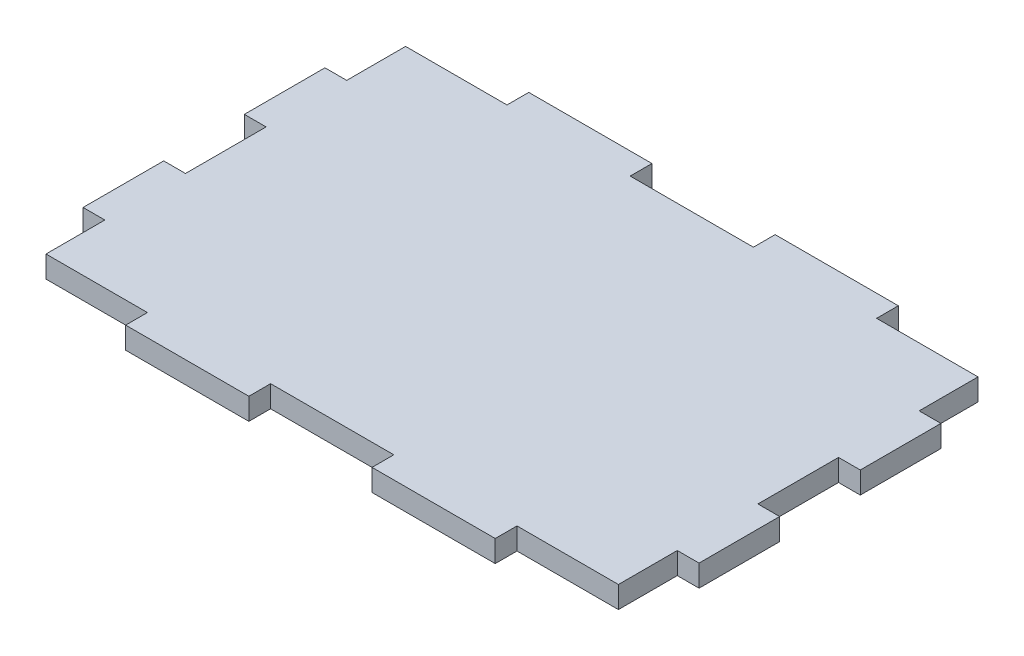
ISO-10303-21;
HEADER;
FILE_DESCRIPTION(('STEP AP214'),'2;1');
FILE_NAME('part.step','',(''),(''),'','','');
FILE_SCHEMA(('AUTOMOTIVE_DESIGN { 1 0 10303 214 1 1 1 1 }'));
ENDSEC;
DATA;
#1=APPLICATION_CONTEXT('core data for automotive mechanical design processes');
#2=APPLICATION_PROTOCOL_DEFINITION('international standard','automotive_design',2000,#1);
#3=PRODUCT_CONTEXT('',#1,'mechanical');
#4=PRODUCT('Part','Part','',(#3));
#5=PRODUCT_RELATED_PRODUCT_CATEGORY('part','',(#4));
#6=PRODUCT_DEFINITION_FORMATION('','',#4);
#7=PRODUCT_DEFINITION_CONTEXT('part definition',#1,'design');
#8=PRODUCT_DEFINITION('design','',#6,#7);
#9=PRODUCT_DEFINITION_SHAPE('','',#8);
#10=(LENGTH_UNIT() NAMED_UNIT(*) SI_UNIT(.MILLI.,.METRE.));
#11=(NAMED_UNIT(*) PLANE_ANGLE_UNIT() SI_UNIT($,.RADIAN.));
#12=(NAMED_UNIT(*) SI_UNIT($,.STERADIAN.) SOLID_ANGLE_UNIT());
#13=UNCERTAINTY_MEASURE_WITH_UNIT(LENGTH_MEASURE(1.E-05),#10,'distance_accuracy_value','');
#14=(GEOMETRIC_REPRESENTATION_CONTEXT(3) GLOBAL_UNCERTAINTY_ASSIGNED_CONTEXT((#13)) GLOBAL_UNIT_ASSIGNED_CONTEXT((#10,
#11,#12)) REPRESENTATION_CONTEXT('',''));
#15=CARTESIAN_POINT('',(0.,0.,0.));
#16=DIRECTION('',(0.,0.,1.));
#17=DIRECTION('',(1.,0.,0.));
#18=AXIS2_PLACEMENT_3D('',#15,#16,#17);
#19=CARTESIAN_POINT('',(-35.5,-2.7,15.));
#20=DIRECTION('',(-1.,0.,0.));
#21=DIRECTION('',(0.,0.,1.));
#22=AXIS2_PLACEMENT_3D('',#19,#20,#21);
#23=PLANE('',#22);
#24=DIRECTION('',(0.,0.,1.));
#25=VECTOR('',#24,1.);
#26=CARTESIAN_POINT('',(-35.5,0.,15.));
#27=LINE('',#26,#25);
#28=CARTESIAN_POINT('',(-35.5,0.,15.));
#29=VERTEX_POINT('',#28);
#30=CARTESIAN_POINT('',(-35.5,0.,22.3));
#31=VERTEX_POINT('',#30);
#32=EDGE_CURVE('E298',#29,#31,#27,.T.);
#33=ORIENTED_EDGE('',*,*,#32,.F.);
#34=DIRECTION('',(0.,1.,0.));
#35=VECTOR('',#34,1.);
#36=CARTESIAN_POINT('',(-35.5,-2.7,15.));
#37=LINE('',#36,#35);
#38=CARTESIAN_POINT('',(-35.5,-2.7,15.));
#39=VERTEX_POINT('',#38);
#40=EDGE_CURVE('E11',#39,#29,#37,.T.);
#41=ORIENTED_EDGE('',*,*,#40,.F.);
#42=DIRECTION('',(0.,0.,1.));
#43=VECTOR('',#42,1.);
#44=CARTESIAN_POINT('',(-35.5,-2.7,15.));
#45=LINE('',#44,#43);
#46=CARTESIAN_POINT('',(-35.5,-2.7,22.3));
#47=VERTEX_POINT('',#46);
#48=EDGE_CURVE('E402',#39,#47,#45,.T.);
#49=ORIENTED_EDGE('',*,*,#48,.T.);
#50=DIRECTION('',(0.,1.,0.));
#51=VECTOR('',#50,1.);
#52=CARTESIAN_POINT('',(-35.5,-2.7,22.3));
#53=LINE('',#52,#51);
#54=EDGE_CURVE('E36',#47,#31,#53,.T.);
#55=ORIENTED_EDGE('',*,*,#54,.T.);
#56=EDGE_LOOP('',(#33,#41,#49,#55));
#57=FACE_BOUND('',#56,.T.);
#58=ADVANCED_FACE('F33',(#57),#23,.T.);
#59=CARTESIAN_POINT('',(-38.2,-2.7,15.));
#60=DIRECTION('',(0.,0.,1.));
#61=DIRECTION('',(1.,0.,0.));
#62=AXIS2_PLACEMENT_3D('',#59,#60,#61);
#63=PLANE('',#62);
#64=DIRECTION('',(1.,0.,0.));
#65=VECTOR('',#64,1.);
#66=CARTESIAN_POINT('',(-38.2,0.,15.));
#67=LINE('',#66,#65);
#68=CARTESIAN_POINT('',(-38.2,0.,15.));
#69=VERTEX_POINT('',#68);
#70=EDGE_CURVE('E400',#69,#29,#67,.T.);
#71=ORIENTED_EDGE('',*,*,#70,.F.);
#72=DIRECTION('',(0.,1.,0.));
#73=VECTOR('',#72,1.);
#74=CARTESIAN_POINT('',(-38.2,-2.7,15.));
#75=LINE('',#74,#73);
#76=CARTESIAN_POINT('',(-38.2,-2.7,15.));
#77=VERTEX_POINT('',#76);
#78=EDGE_CURVE('E42',#77,#69,#75,.T.);
#79=ORIENTED_EDGE('',*,*,#78,.F.);
#80=DIRECTION('',(1.,0.,0.));
#81=VECTOR('',#80,1.);
#82=CARTESIAN_POINT('',(-38.2,-2.7,15.));
#83=LINE('',#82,#81);
#84=EDGE_CURVE('E288',#77,#39,#83,.T.);
#85=ORIENTED_EDGE('',*,*,#84,.T.);
#86=ORIENTED_EDGE('',*,*,#40,.T.);
#87=EDGE_LOOP('',(#71,#79,#85,#86));
#88=FACE_BOUND('',#87,.T.);
#89=ADVANCED_FACE('F470',(#88),#63,.T.);
#90=CARTESIAN_POINT('',(-38.2,-2.7,15.));
#91=DIRECTION('',(-1.,0.,0.));
#92=DIRECTION('',(0.,0.,1.));
#93=AXIS2_PLACEMENT_3D('',#90,#91,#92);
#94=PLANE('',#93);
#95=DIRECTION('',(0.,0.,1.));
#96=VECTOR('',#95,1.);
#97=CARTESIAN_POINT('',(-38.2,0.,15.));
#98=LINE('',#97,#96);
#99=CARTESIAN_POINT('',(-38.2,0.,5.));
#100=VERTEX_POINT('',#99);
#101=EDGE_CURVE('E275',#100,#69,#98,.T.);
#102=ORIENTED_EDGE('',*,*,#101,.F.);
#103=DIRECTION('',(0.,1.,0.));
#104=VECTOR('',#103,1.);
#105=CARTESIAN_POINT('',(-38.2,-2.7,5.));
#106=LINE('',#105,#104);
#107=CARTESIAN_POINT('',(-38.2,-2.7,5.));
#108=VERTEX_POINT('',#107);
#109=EDGE_CURVE('E270',#108,#100,#106,.T.);
#110=ORIENTED_EDGE('',*,*,#109,.F.);
#111=DIRECTION('',(0.,0.,1.));
#112=VECTOR('',#111,1.);
#113=CARTESIAN_POINT('',(-38.2,-2.7,15.));
#114=LINE('',#113,#112);
#115=EDGE_CURVE('E273',#108,#77,#114,.T.);
#116=ORIENTED_EDGE('',*,*,#115,.T.);
#117=ORIENTED_EDGE('',*,*,#78,.T.);
#118=EDGE_LOOP('',(#102,#110,#116,#117));
#119=FACE_BOUND('',#118,.T.);
#120=ADVANCED_FACE('F272',(#119),#94,.T.);
#121=CARTESIAN_POINT('',(-38.2,-2.7,5.));
#122=DIRECTION('',(0.,0.,-1.));
#123=DIRECTION('',(-1.,0.,0.));
#124=AXIS2_PLACEMENT_3D('',#121,#122,#123);
#125=PLANE('',#124);
#126=DIRECTION('',(-1.,0.,0.));
#127=VECTOR('',#126,1.);
#128=CARTESIAN_POINT('',(-38.2,0.,5.));
#129=LINE('',#128,#127);
#130=CARTESIAN_POINT('',(-35.5,0.,5.));
#131=VERTEX_POINT('',#130);
#132=EDGE_CURVE('E397',#131,#100,#129,.T.);
#133=ORIENTED_EDGE('',*,*,#132,.F.);
#134=DIRECTION('',(0.,1.,0.));
#135=VECTOR('',#134,1.);
#136=CARTESIAN_POINT('',(-35.5,-2.7,5.));
#137=LINE('',#136,#135);
#138=CARTESIAN_POINT('',(-35.5,-2.7,5.));
#139=VERTEX_POINT('',#138);
#140=EDGE_CURVE('E280',#139,#131,#137,.T.);
#141=ORIENTED_EDGE('',*,*,#140,.F.);
#142=DIRECTION('',(-1.,0.,0.));
#143=VECTOR('',#142,1.);
#144=CARTESIAN_POINT('',(-38.2,-2.7,5.));
#145=LINE('',#144,#143);
#146=EDGE_CURVE('E286',#139,#108,#145,.T.);
#147=ORIENTED_EDGE('',*,*,#146,.T.);
#148=ORIENTED_EDGE('',*,*,#109,.T.);
#149=EDGE_LOOP('',(#133,#141,#147,#148));
#150=FACE_BOUND('',#149,.T.);
#151=ADVANCED_FACE('F290',(#150),#125,.T.);
#152=CARTESIAN_POINT('',(-35.5,-2.7,-5.));
#153=DIRECTION('',(-1.,0.,0.));
#154=DIRECTION('',(0.,0.,1.));
#155=AXIS2_PLACEMENT_3D('',#152,#153,#154);
#156=PLANE('',#155);
#157=DIRECTION('',(0.,0.,1.));
#158=VECTOR('',#157,1.);
#159=CARTESIAN_POINT('',(-35.5,0.,-5.));
#160=LINE('',#159,#158);
#161=CARTESIAN_POINT('',(-35.5,0.,-5.));
#162=VERTEX_POINT('',#161);
#163=EDGE_CURVE('E394',#162,#131,#160,.T.);
#164=ORIENTED_EDGE('',*,*,#163,.F.);
#165=DIRECTION('',(0.,1.,0.));
#166=VECTOR('',#165,1.);
#167=CARTESIAN_POINT('',(-35.5,-2.7,-5.));
#168=LINE('',#167,#166);
#169=CARTESIAN_POINT('',(-35.5,-2.7,-5.));
#170=VERTEX_POINT('',#169);
#171=EDGE_CURVE('E406',#170,#162,#168,.T.);
#172=ORIENTED_EDGE('',*,*,#171,.F.);
#173=DIRECTION('',(0.,0.,1.));
#174=VECTOR('',#173,1.);
#175=CARTESIAN_POINT('',(-35.5,-2.7,-5.));
#176=LINE('',#175,#174);
#177=EDGE_CURVE('E291',#170,#139,#176,.T.);
#178=ORIENTED_EDGE('',*,*,#177,.T.);
#179=ORIENTED_EDGE('',*,*,#140,.T.);
#180=EDGE_LOOP('',(#164,#172,#178,#179));
#181=FACE_BOUND('',#180,.T.);
#182=ADVANCED_FACE('F483',(#181),#156,.T.);
#183=CARTESIAN_POINT('',(-38.2,-2.7,-5.));
#184=DIRECTION('',(0.,0.,1.));
#185=DIRECTION('',(1.,0.,0.));
#186=AXIS2_PLACEMENT_3D('',#183,#184,#185);
#187=PLANE('',#186);
#188=DIRECTION('',(1.,0.,0.));
#189=VECTOR('',#188,1.);
#190=CARTESIAN_POINT('',(-38.2,0.,-5.));
#191=LINE('',#190,#189);
#192=CARTESIAN_POINT('',(-38.2,0.,-5.));
#193=VERTEX_POINT('',#192);
#194=EDGE_CURVE('E391',#193,#162,#191,.T.);
#195=ORIENTED_EDGE('',*,*,#194,.F.);
#196=DIRECTION('',(0.,1.,0.));
#197=VECTOR('',#196,1.);
#198=CARTESIAN_POINT('',(-38.2,-2.7,-5.));
#199=LINE('',#198,#197);
#200=CARTESIAN_POINT('',(-38.2,-2.7,-5.));
#201=VERTEX_POINT('',#200);
#202=EDGE_CURVE('E408',#201,#193,#199,.T.);
#203=ORIENTED_EDGE('',*,*,#202,.F.);
#204=DIRECTION('',(1.,0.,0.));
#205=VECTOR('',#204,1.);
#206=CARTESIAN_POINT('',(-38.2,-2.7,-5.));
#207=LINE('',#206,#205);
#208=EDGE_CURVE('E293',#201,#170,#207,.T.);
#209=ORIENTED_EDGE('',*,*,#208,.T.);
#210=ORIENTED_EDGE('',*,*,#171,.T.);
#211=EDGE_LOOP('',(#195,#203,#209,#210));
#212=FACE_BOUND('',#211,.T.);
#213=ADVANCED_FACE('F486',(#212),#187,.T.);
#214=CARTESIAN_POINT('',(-38.2,-2.7,-5.));
#215=DIRECTION('',(-1.,0.,0.));
#216=DIRECTION('',(0.,0.,1.));
#217=AXIS2_PLACEMENT_3D('',#214,#215,#216);
#218=PLANE('',#217);
#219=DIRECTION('',(0.,0.,1.));
#220=VECTOR('',#219,1.);
#221=CARTESIAN_POINT('',(-38.2,0.,-5.));
#222=LINE('',#221,#220);
#223=CARTESIAN_POINT('',(-38.2,0.,-15.));
#224=VERTEX_POINT('',#223);
#225=EDGE_CURVE('E388',#224,#193,#222,.T.);
#226=ORIENTED_EDGE('',*,*,#225,.F.);
#227=DIRECTION('',(0.,1.,0.));
#228=VECTOR('',#227,1.);
#229=CARTESIAN_POINT('',(-38.2,-2.7,-15.));
#230=LINE('',#229,#228);
#231=CARTESIAN_POINT('',(-38.2,-2.7,-15.));
#232=VERTEX_POINT('',#231);
#233=EDGE_CURVE('E410',#232,#224,#230,.T.);
#234=ORIENTED_EDGE('',*,*,#233,.F.);
#235=DIRECTION('',(0.,0.,1.));
#236=VECTOR('',#235,1.);
#237=CARTESIAN_POINT('',(-38.2,-2.7,-5.));
#238=LINE('',#237,#236);
#239=EDGE_CURVE('E940',#232,#201,#238,.T.);
#240=ORIENTED_EDGE('',*,*,#239,.T.);
#241=ORIENTED_EDGE('',*,*,#202,.T.);
#242=EDGE_LOOP('',(#226,#234,#240,#241));
#243=FACE_BOUND('',#242,.T.);
#244=ADVANCED_FACE('F490',(#243),#218,.T.);
#245=CARTESIAN_POINT('',(-38.2,-2.7,-15.));
#246=DIRECTION('',(0.,0.,-1.));
#247=DIRECTION('',(-1.,0.,0.));
#248=AXIS2_PLACEMENT_3D('',#245,#246,#247);
#249=PLANE('',#248);
#250=DIRECTION('',(-1.,0.,0.));
#251=VECTOR('',#250,1.);
#252=CARTESIAN_POINT('',(-38.2,0.,-15.));
#253=LINE('',#252,#251);
#254=CARTESIAN_POINT('',(-35.5,0.,-15.));
#255=VERTEX_POINT('',#254);
#256=EDGE_CURVE('E385',#255,#224,#253,.T.);
#257=ORIENTED_EDGE('',*,*,#256,.F.);
#258=DIRECTION('',(0.,1.,0.));
#259=VECTOR('',#258,1.);
#260=CARTESIAN_POINT('',(-35.5,-2.7,-15.));
#261=LINE('',#260,#259);
#262=CARTESIAN_POINT('',(-35.5,-2.7,-15.));
#263=VERTEX_POINT('',#262);
#264=EDGE_CURVE('E412',#263,#255,#261,.T.);
#265=ORIENTED_EDGE('',*,*,#264,.F.);
#266=DIRECTION('',(-1.,0.,0.));
#267=VECTOR('',#266,1.);
#268=CARTESIAN_POINT('',(-38.2,-2.7,-15.));
#269=LINE('',#268,#267);
#270=EDGE_CURVE('E944',#263,#232,#269,.T.);
#271=ORIENTED_EDGE('',*,*,#270,.T.);
#272=ORIENTED_EDGE('',*,*,#233,.T.);
#273=EDGE_LOOP('',(#257,#265,#271,#272));
#274=FACE_BOUND('',#273,.T.);
#275=ADVANCED_FACE('F494',(#274),#249,.T.);
#276=CARTESIAN_POINT('',(-35.5,-2.7,-22.3));
#277=DIRECTION('',(-1.,0.,0.));
#278=DIRECTION('',(0.,0.,1.));
#279=AXIS2_PLACEMENT_3D('',#276,#277,#278);
#280=PLANE('',#279);
#281=DIRECTION('',(0.,0.,1.));
#282=VECTOR('',#281,1.);
#283=CARTESIAN_POINT('',(-35.5,0.,-22.3));
#284=LINE('',#283,#282);
#285=CARTESIAN_POINT('',(-35.5,0.,-22.3));
#286=VERTEX_POINT('',#285);
#287=EDGE_CURVE('E382',#286,#255,#284,.T.);
#288=ORIENTED_EDGE('',*,*,#287,.F.);
#289=DIRECTION('',(0.,1.,0.));
#290=VECTOR('',#289,1.);
#291=CARTESIAN_POINT('',(-35.5,-2.7,-22.3));
#292=LINE('',#291,#290);
#293=CARTESIAN_POINT('',(-35.5,-2.7,-22.3));
#294=VERTEX_POINT('',#293);
#295=EDGE_CURVE('E414',#294,#286,#292,.T.);
#296=ORIENTED_EDGE('',*,*,#295,.F.);
#297=DIRECTION('',(0.,0.,1.));
#298=VECTOR('',#297,1.);
#299=CARTESIAN_POINT('',(-35.5,-2.7,-22.3));
#300=LINE('',#299,#298);
#301=EDGE_CURVE('E933',#294,#263,#300,.T.);
#302=ORIENTED_EDGE('',*,*,#301,.T.);
#303=ORIENTED_EDGE('',*,*,#264,.T.);
#304=EDGE_LOOP('',(#288,#296,#302,#303));
#305=FACE_BOUND('',#304,.T.);
#306=ADVANCED_FACE('F498',(#305),#280,.T.);
#307=CARTESIAN_POINT('',(-22.92,-2.7,-22.3));
#308=DIRECTION('',(0.,0.,-1.));
#309=DIRECTION('',(-1.,0.,0.));
#310=AXIS2_PLACEMENT_3D('',#307,#308,#309);
#311=PLANE('',#310);
#312=DIRECTION('',(-1.,0.,0.));
#313=VECTOR('',#312,1.);
#314=CARTESIAN_POINT('',(-22.92,0.,-22.3));
#315=LINE('',#314,#313);
#316=CARTESIAN_POINT('',(-22.92,0.,-22.3));
#317=VERTEX_POINT('',#316);
#318=EDGE_CURVE('E379',#317,#286,#315,.T.);
#319=ORIENTED_EDGE('',*,*,#318,.F.);
#320=DIRECTION('',(0.,1.,0.));
#321=VECTOR('',#320,1.);
#322=CARTESIAN_POINT('',(-22.92,-2.7,-22.3));
#323=LINE('',#322,#321);
#324=CARTESIAN_POINT('',(-22.92,-2.7,-22.3));
#325=VERTEX_POINT('',#324);
#326=EDGE_CURVE('E416',#325,#317,#323,.T.);
#327=ORIENTED_EDGE('',*,*,#326,.F.);
#328=DIRECTION('',(-1.,0.,0.));
#329=VECTOR('',#328,1.);
#330=CARTESIAN_POINT('',(-22.92,-2.7,-22.3));
#331=LINE('',#330,#329);
#332=EDGE_CURVE('E929',#325,#294,#331,.T.);
#333=ORIENTED_EDGE('',*,*,#332,.T.);
#334=ORIENTED_EDGE('',*,*,#295,.T.);
#335=EDGE_LOOP('',(#319,#327,#333,#334));
#336=FACE_BOUND('',#335,.T.);
#337=ADVANCED_FACE('F502',(#336),#311,.T.);
#338=CARTESIAN_POINT('',(-22.92,-2.7,-22.3));
#339=DIRECTION('',(-1.,0.,0.));
#340=DIRECTION('',(0.,0.,1.));
#341=AXIS2_PLACEMENT_3D('',#338,#339,#340);
#342=PLANE('',#341);
#343=DIRECTION('',(0.,0.,1.));
#344=VECTOR('',#343,1.);
#345=CARTESIAN_POINT('',(-22.92,0.,-22.3));
#346=LINE('',#345,#344);
#347=CARTESIAN_POINT('',(-22.92,0.,-25.));
#348=VERTEX_POINT('',#347);
#349=EDGE_CURVE('E376',#348,#317,#346,.T.);
#350=ORIENTED_EDGE('',*,*,#349,.F.);
#351=DIRECTION('',(0.,1.,0.));
#352=VECTOR('',#351,1.);
#353=CARTESIAN_POINT('',(-22.92,-2.7,-25.));
#354=LINE('',#353,#352);
#355=CARTESIAN_POINT('',(-22.92,-2.7,-25.));
#356=VERTEX_POINT('',#355);
#357=EDGE_CURVE('E418',#356,#348,#354,.T.);
#358=ORIENTED_EDGE('',*,*,#357,.F.);
#359=DIRECTION('',(0.,0.,1.));
#360=VECTOR('',#359,1.);
#361=CARTESIAN_POINT('',(-22.92,-2.7,-22.3));
#362=LINE('',#361,#360);
#363=EDGE_CURVE('E950',#356,#325,#362,.T.);
#364=ORIENTED_EDGE('',*,*,#363,.T.);
#365=ORIENTED_EDGE('',*,*,#326,.T.);
#366=EDGE_LOOP('',(#350,#358,#364,#365));
#367=FACE_BOUND('',#366,.T.);
#368=ADVANCED_FACE('F506',(#367),#342,.T.);
#369=CARTESIAN_POINT('',(-7.64000000000001,-2.7,-25.));
#370=DIRECTION('',(0.,0.,-1.));
#371=DIRECTION('',(-1.,0.,0.));
#372=AXIS2_PLACEMENT_3D('',#369,#370,#371);
#373=PLANE('',#372);
#374=DIRECTION('',(-1.,0.,0.));
#375=VECTOR('',#374,1.);
#376=CARTESIAN_POINT('',(-7.64000000000001,0.,-25.));
#377=LINE('',#376,#375);
#378=CARTESIAN_POINT('',(-7.64000000000001,0.,-25.));
#379=VERTEX_POINT('',#378);
#380=EDGE_CURVE('E373',#379,#348,#377,.T.);
#381=ORIENTED_EDGE('',*,*,#380,.F.);
#382=DIRECTION('',(0.,1.,0.));
#383=VECTOR('',#382,1.);
#384=CARTESIAN_POINT('',(-7.64000000000001,-2.7,-25.));
#385=LINE('',#384,#383);
#386=CARTESIAN_POINT('',(-7.64000000000001,-2.7,-25.));
#387=VERTEX_POINT('',#386);
#388=EDGE_CURVE('E420',#387,#379,#385,.T.);
#389=ORIENTED_EDGE('',*,*,#388,.F.);
#390=DIRECTION('',(-1.,0.,0.));
#391=VECTOR('',#390,1.);
#392=CARTESIAN_POINT('',(-7.64000000000001,-2.7,-25.));
#393=LINE('',#392,#391);
#394=EDGE_CURVE('E922',#387,#356,#393,.T.);
#395=ORIENTED_EDGE('',*,*,#394,.T.);
#396=ORIENTED_EDGE('',*,*,#357,.T.);
#397=EDGE_LOOP('',(#381,#389,#395,#396));
#398=FACE_BOUND('',#397,.T.);
#399=ADVANCED_FACE('F510',(#398),#373,.T.);
#400=CARTESIAN_POINT('',(-7.64000000000001,-2.7,-22.3));
#401=DIRECTION('',(1.,0.,0.));
#402=DIRECTION('',(0.,0.,-1.));
#403=AXIS2_PLACEMENT_3D('',#400,#401,#402);
#404=PLANE('',#403);
#405=DIRECTION('',(0.,0.,-1.));
#406=VECTOR('',#405,1.);
#407=CARTESIAN_POINT('',(-7.64000000000001,0.,-22.3));
#408=LINE('',#407,#406);
#409=CARTESIAN_POINT('',(-7.64000000000001,0.,-22.3));
#410=VERTEX_POINT('',#409);
#411=EDGE_CURVE('E370',#410,#379,#408,.T.);
#412=ORIENTED_EDGE('',*,*,#411,.F.);
#413=DIRECTION('',(0.,1.,0.));
#414=VECTOR('',#413,1.);
#415=CARTESIAN_POINT('',(-7.64000000000001,-2.7,-22.3));
#416=LINE('',#415,#414);
#417=CARTESIAN_POINT('',(-7.64000000000001,-2.7,-22.3));
#418=VERTEX_POINT('',#417);
#419=EDGE_CURVE('E422',#418,#410,#416,.T.);
#420=ORIENTED_EDGE('',*,*,#419,.F.);
#421=DIRECTION('',(0.,0.,-1.));
#422=VECTOR('',#421,1.);
#423=CARTESIAN_POINT('',(-7.64000000000001,-2.7,-22.3));
#424=LINE('',#423,#422);
#425=EDGE_CURVE('E918',#418,#387,#424,.T.);
#426=ORIENTED_EDGE('',*,*,#425,.T.);
#427=ORIENTED_EDGE('',*,*,#388,.T.);
#428=EDGE_LOOP('',(#412,#420,#426,#427));
#429=FACE_BOUND('',#428,.T.);
#430=ADVANCED_FACE('F514',(#429),#404,.T.);
#431=CARTESIAN_POINT('',(7.63999999999999,-2.7,-22.3));
#432=DIRECTION('',(0.,0.,-1.));
#433=DIRECTION('',(-1.,0.,0.));
#434=AXIS2_PLACEMENT_3D('',#431,#432,#433);
#435=PLANE('',#434);
#436=DIRECTION('',(-1.,0.,0.));
#437=VECTOR('',#436,1.);
#438=CARTESIAN_POINT('',(7.63999999999999,0.,-22.3));
#439=LINE('',#438,#437);
#440=CARTESIAN_POINT('',(7.63999999999999,0.,-22.3));
#441=VERTEX_POINT('',#440);
#442=EDGE_CURVE('E367',#441,#410,#439,.T.);
#443=ORIENTED_EDGE('',*,*,#442,.F.);
#444=DIRECTION('',(0.,1.,0.));
#445=VECTOR('',#444,1.);
#446=CARTESIAN_POINT('',(7.63999999999999,-2.7,-22.3));
#447=LINE('',#446,#445);
#448=CARTESIAN_POINT('',(7.63999999999999,-2.7,-22.3));
#449=VERTEX_POINT('',#448);
#450=EDGE_CURVE('E424',#449,#441,#447,.T.);
#451=ORIENTED_EDGE('',*,*,#450,.F.);
#452=DIRECTION('',(-1.,0.,0.));
#453=VECTOR('',#452,1.);
#454=CARTESIAN_POINT('',(7.63999999999999,-2.7,-22.3));
#455=LINE('',#454,#453);
#456=EDGE_CURVE('E954',#449,#418,#455,.T.);
#457=ORIENTED_EDGE('',*,*,#456,.T.);
#458=ORIENTED_EDGE('',*,*,#419,.T.);
#459=EDGE_LOOP('',(#443,#451,#457,#458));
#460=FACE_BOUND('',#459,.T.);
#461=ADVANCED_FACE('F518',(#460),#435,.T.);
#462=CARTESIAN_POINT('',(7.63999999999999,-2.7,-22.3));
#463=DIRECTION('',(-1.,0.,0.));
#464=DIRECTION('',(0.,0.,1.));
#465=AXIS2_PLACEMENT_3D('',#462,#463,#464);
#466=PLANE('',#465);
#467=DIRECTION('',(0.,0.,1.));
#468=VECTOR('',#467,1.);
#469=CARTESIAN_POINT('',(7.63999999999999,0.,-22.3));
#470=LINE('',#469,#468);
#471=CARTESIAN_POINT('',(7.63999999999999,0.,-25.));
#472=VERTEX_POINT('',#471);
#473=EDGE_CURVE('E364',#472,#441,#470,.T.);
#474=ORIENTED_EDGE('',*,*,#473,.F.);
#475=DIRECTION('',(0.,1.,0.));
#476=VECTOR('',#475,1.);
#477=CARTESIAN_POINT('',(7.63999999999999,-2.7,-25.));
#478=LINE('',#477,#476);
#479=CARTESIAN_POINT('',(7.63999999999999,-2.7,-25.));
#480=VERTEX_POINT('',#479);
#481=EDGE_CURVE('E426',#480,#472,#478,.T.);
#482=ORIENTED_EDGE('',*,*,#481,.F.);
#483=DIRECTION('',(0.,0.,1.));
#484=VECTOR('',#483,1.);
#485=CARTESIAN_POINT('',(7.63999999999999,-2.7,-22.3));
#486=LINE('',#485,#484);
#487=EDGE_CURVE('E911',#480,#449,#486,.T.);
#488=ORIENTED_EDGE('',*,*,#487,.T.);
#489=ORIENTED_EDGE('',*,*,#450,.T.);
#490=EDGE_LOOP('',(#474,#482,#488,#489));
#491=FACE_BOUND('',#490,.T.);
#492=ADVANCED_FACE('F522',(#491),#466,.T.);
#493=CARTESIAN_POINT('',(22.92,-2.7,-25.));
#494=DIRECTION('',(0.,0.,-1.));
#495=DIRECTION('',(-1.,0.,0.));
#496=AXIS2_PLACEMENT_3D('',#493,#494,#495);
#497=PLANE('',#496);
#498=DIRECTION('',(-1.,0.,0.));
#499=VECTOR('',#498,1.);
#500=CARTESIAN_POINT('',(22.92,0.,-25.));
#501=LINE('',#500,#499);
#502=CARTESIAN_POINT('',(22.92,0.,-25.));
#503=VERTEX_POINT('',#502);
#504=EDGE_CURVE('E361',#503,#472,#501,.T.);
#505=ORIENTED_EDGE('',*,*,#504,.F.);
#506=DIRECTION('',(0.,1.,0.));
#507=VECTOR('',#506,1.);
#508=CARTESIAN_POINT('',(22.92,-2.7,-25.));
#509=LINE('',#508,#507);
#510=CARTESIAN_POINT('',(22.92,-2.7,-25.));
#511=VERTEX_POINT('',#510);
#512=EDGE_CURVE('E428',#511,#503,#509,.T.);
#513=ORIENTED_EDGE('',*,*,#512,.F.);
#514=DIRECTION('',(-1.,0.,0.));
#515=VECTOR('',#514,1.);
#516=CARTESIAN_POINT('',(22.92,-2.7,-25.));
#517=LINE('',#516,#515);
#518=EDGE_CURVE('E907',#511,#480,#517,.T.);
#519=ORIENTED_EDGE('',*,*,#518,.T.);
#520=ORIENTED_EDGE('',*,*,#481,.T.);
#521=EDGE_LOOP('',(#505,#513,#519,#520));
#522=FACE_BOUND('',#521,.T.);
#523=ADVANCED_FACE('F526',(#522),#497,.T.);
#524=CARTESIAN_POINT('',(22.92,-2.7,-22.3));
#525=DIRECTION('',(1.,0.,0.));
#526=DIRECTION('',(0.,0.,-1.));
#527=AXIS2_PLACEMENT_3D('',#524,#525,#526);
#528=PLANE('',#527);
#529=DIRECTION('',(0.,0.,-1.));
#530=VECTOR('',#529,1.);
#531=CARTESIAN_POINT('',(22.92,0.,-22.3));
#532=LINE('',#531,#530);
#533=CARTESIAN_POINT('',(22.92,0.,-22.3));
#534=VERTEX_POINT('',#533);
#535=EDGE_CURVE('E358',#534,#503,#532,.T.);
#536=ORIENTED_EDGE('',*,*,#535,.F.);
#537=DIRECTION('',(0.,1.,0.));
#538=VECTOR('',#537,1.);
#539=CARTESIAN_POINT('',(22.92,-2.7,-22.3));
#540=LINE('',#539,#538);
#541=CARTESIAN_POINT('',(22.92,-2.7,-22.3));
#542=VERTEX_POINT('',#541);
#543=EDGE_CURVE('E430',#542,#534,#540,.T.);
#544=ORIENTED_EDGE('',*,*,#543,.F.);
#545=DIRECTION('',(0.,0.,-1.));
#546=VECTOR('',#545,1.);
#547=CARTESIAN_POINT('',(22.92,-2.7,-22.3));
#548=LINE('',#547,#546);
#549=EDGE_CURVE('E958',#542,#511,#548,.T.);
#550=ORIENTED_EDGE('',*,*,#549,.T.);
#551=ORIENTED_EDGE('',*,*,#512,.T.);
#552=EDGE_LOOP('',(#536,#544,#550,#551));
#553=FACE_BOUND('',#552,.T.);
#554=ADVANCED_FACE('F530',(#553),#528,.T.);
#555=CARTESIAN_POINT('',(35.5,-2.7,-22.3));
#556=DIRECTION('',(0.,0.,-1.));
#557=DIRECTION('',(-1.,0.,0.));
#558=AXIS2_PLACEMENT_3D('',#555,#556,#557);
#559=PLANE('',#558);
#560=DIRECTION('',(-1.,0.,0.));
#561=VECTOR('',#560,1.);
#562=CARTESIAN_POINT('',(35.5,0.,-22.3));
#563=LINE('',#562,#561);
#564=CARTESIAN_POINT('',(35.5,0.,-22.3));
#565=VERTEX_POINT('',#564);
#566=EDGE_CURVE('E355',#565,#534,#563,.T.);
#567=ORIENTED_EDGE('',*,*,#566,.F.);
#568=DIRECTION('',(0.,1.,0.));
#569=VECTOR('',#568,1.);
#570=CARTESIAN_POINT('',(35.5,-2.7,-22.3));
#571=LINE('',#570,#569);
#572=CARTESIAN_POINT('',(35.5,-2.7,-22.3));
#573=VERTEX_POINT('',#572);
#574=EDGE_CURVE('E432',#573,#565,#571,.T.);
#575=ORIENTED_EDGE('',*,*,#574,.F.);
#576=DIRECTION('',(-1.,0.,0.));
#577=VECTOR('',#576,1.);
#578=CARTESIAN_POINT('',(35.5,-2.7,-22.3));
#579=LINE('',#578,#577);
#580=EDGE_CURVE('E900',#573,#542,#579,.T.);
#581=ORIENTED_EDGE('',*,*,#580,.T.);
#582=ORIENTED_EDGE('',*,*,#543,.T.);
#583=EDGE_LOOP('',(#567,#575,#581,#582));
#584=FACE_BOUND('',#583,.T.);
#585=ADVANCED_FACE('F534',(#584),#559,.T.);
#586=CARTESIAN_POINT('',(35.5,-2.7,-15.));
#587=DIRECTION('',(1.,0.,0.));
#588=DIRECTION('',(0.,0.,-1.));
#589=AXIS2_PLACEMENT_3D('',#586,#587,#588);
#590=PLANE('',#589);
#591=DIRECTION('',(0.,0.,-1.));
#592=VECTOR('',#591,1.);
#593=CARTESIAN_POINT('',(35.5,0.,-15.));
#594=LINE('',#593,#592);
#595=CARTESIAN_POINT('',(35.5,0.,-15.));
#596=VERTEX_POINT('',#595);
#597=EDGE_CURVE('E352',#596,#565,#594,.T.);
#598=ORIENTED_EDGE('',*,*,#597,.F.);
#599=DIRECTION('',(0.,1.,0.));
#600=VECTOR('',#599,1.);
#601=CARTESIAN_POINT('',(35.5,-2.7,-15.));
#602=LINE('',#601,#600);
#603=CARTESIAN_POINT('',(35.5,-2.7,-15.));
#604=VERTEX_POINT('',#603);
#605=EDGE_CURVE('E434',#604,#596,#602,.T.);
#606=ORIENTED_EDGE('',*,*,#605,.F.);
#607=DIRECTION('',(0.,0.,-1.));
#608=VECTOR('',#607,1.);
#609=CARTESIAN_POINT('',(35.5,-2.7,-15.));
#610=LINE('',#609,#608);
#611=EDGE_CURVE('E896',#604,#573,#610,.T.);
#612=ORIENTED_EDGE('',*,*,#611,.T.);
#613=ORIENTED_EDGE('',*,*,#574,.T.);
#614=EDGE_LOOP('',(#598,#606,#612,#613));
#615=FACE_BOUND('',#614,.T.);
#616=ADVANCED_FACE('F538',(#615),#590,.T.);
#617=CARTESIAN_POINT('',(35.5,-2.7,-15.));
#618=DIRECTION('',(0.,0.,-1.));
#619=DIRECTION('',(-1.,0.,0.));
#620=AXIS2_PLACEMENT_3D('',#617,#618,#619);
#621=PLANE('',#620);
#622=DIRECTION('',(-1.,0.,0.));
#623=VECTOR('',#622,1.);
#624=CARTESIAN_POINT('',(35.5,0.,-15.));
#625=LINE('',#624,#623);
#626=CARTESIAN_POINT('',(38.2,0.,-15.));
#627=VERTEX_POINT('',#626);
#628=EDGE_CURVE('E349',#627,#596,#625,.T.);
#629=ORIENTED_EDGE('',*,*,#628,.F.);
#630=DIRECTION('',(0.,1.,0.));
#631=VECTOR('',#630,1.);
#632=CARTESIAN_POINT('',(38.2,-2.7,-15.));
#633=LINE('',#632,#631);
#634=CARTESIAN_POINT('',(38.2,-2.7,-15.));
#635=VERTEX_POINT('',#634);
#636=EDGE_CURVE('E436',#635,#627,#633,.T.);
#637=ORIENTED_EDGE('',*,*,#636,.F.);
#638=DIRECTION('',(-1.,0.,0.));
#639=VECTOR('',#638,1.);
#640=CARTESIAN_POINT('',(35.5,-2.7,-15.));
#641=LINE('',#640,#639);
#642=EDGE_CURVE('E962',#635,#604,#641,.T.);
#643=ORIENTED_EDGE('',*,*,#642,.T.);
#644=ORIENTED_EDGE('',*,*,#605,.T.);
#645=EDGE_LOOP('',(#629,#637,#643,#644));
#646=FACE_BOUND('',#645,.T.);
#647=ADVANCED_FACE('F542',(#646),#621,.T.);
#648=CARTESIAN_POINT('',(38.2,-2.7,-5.));
#649=DIRECTION('',(1.,0.,0.));
#650=DIRECTION('',(0.,0.,-1.));
#651=AXIS2_PLACEMENT_3D('',#648,#649,#650);
#652=PLANE('',#651);
#653=DIRECTION('',(0.,0.,-1.));
#654=VECTOR('',#653,1.);
#655=CARTESIAN_POINT('',(38.2,0.,-5.));
#656=LINE('',#655,#654);
#657=CARTESIAN_POINT('',(38.2,0.,-5.));
#658=VERTEX_POINT('',#657);
#659=EDGE_CURVE('E346',#658,#627,#656,.T.);
#660=ORIENTED_EDGE('',*,*,#659,.F.);
#661=DIRECTION('',(0.,1.,0.));
#662=VECTOR('',#661,1.);
#663=CARTESIAN_POINT('',(38.2,-2.7,-5.));
#664=LINE('',#663,#662);
#665=CARTESIAN_POINT('',(38.2,-2.7,-5.));
#666=VERTEX_POINT('',#665);
#667=EDGE_CURVE('E438',#666,#658,#664,.T.);
#668=ORIENTED_EDGE('',*,*,#667,.F.);
#669=DIRECTION('',(0.,0.,-1.));
#670=VECTOR('',#669,1.);
#671=CARTESIAN_POINT('',(38.2,-2.7,-5.));
#672=LINE('',#671,#670);
#673=EDGE_CURVE('E889',#666,#635,#672,.T.);
#674=ORIENTED_EDGE('',*,*,#673,.T.);
#675=ORIENTED_EDGE('',*,*,#636,.T.);
#676=EDGE_LOOP('',(#660,#668,#674,#675));
#677=FACE_BOUND('',#676,.T.);
#678=ADVANCED_FACE('F546',(#677),#652,.T.);
#679=CARTESIAN_POINT('',(35.5,-2.7,-5.));
#680=DIRECTION('',(0.,0.,1.));
#681=DIRECTION('',(1.,0.,0.));
#682=AXIS2_PLACEMENT_3D('',#679,#680,#681);
#683=PLANE('',#682);
#684=DIRECTION('',(1.,0.,0.));
#685=VECTOR('',#684,1.);
#686=CARTESIAN_POINT('',(35.5,0.,-5.));
#687=LINE('',#686,#685);
#688=CARTESIAN_POINT('',(35.5,0.,-5.));
#689=VERTEX_POINT('',#688);
#690=EDGE_CURVE('E343',#689,#658,#687,.T.);
#691=ORIENTED_EDGE('',*,*,#690,.F.);
#692=DIRECTION('',(0.,1.,0.));
#693=VECTOR('',#692,1.);
#694=CARTESIAN_POINT('',(35.5,-2.7,-5.));
#695=LINE('',#694,#693);
#696=CARTESIAN_POINT('',(35.5,-2.7,-5.));
#697=VERTEX_POINT('',#696);
#698=EDGE_CURVE('E440',#697,#689,#695,.T.);
#699=ORIENTED_EDGE('',*,*,#698,.F.);
#700=DIRECTION('',(1.,0.,0.));
#701=VECTOR('',#700,1.);
#702=CARTESIAN_POINT('',(35.5,-2.7,-5.));
#703=LINE('',#702,#701);
#704=EDGE_CURVE('E885',#697,#666,#703,.T.);
#705=ORIENTED_EDGE('',*,*,#704,.T.);
#706=ORIENTED_EDGE('',*,*,#667,.T.);
#707=EDGE_LOOP('',(#691,#699,#705,#706));
#708=FACE_BOUND('',#707,.T.);
#709=ADVANCED_FACE('F550',(#708),#683,.T.);
#710=CARTESIAN_POINT('',(35.5,-2.7,5.));
#711=DIRECTION('',(1.,0.,0.));
#712=DIRECTION('',(0.,0.,-1.));
#713=AXIS2_PLACEMENT_3D('',#710,#711,#712);
#714=PLANE('',#713);
#715=DIRECTION('',(0.,0.,-1.));
#716=VECTOR('',#715,1.);
#717=CARTESIAN_POINT('',(35.5,0.,5.));
#718=LINE('',#717,#716);
#719=CARTESIAN_POINT('',(35.5,0.,5.));
#720=VERTEX_POINT('',#719);
#721=EDGE_CURVE('E340',#720,#689,#718,.T.);
#722=ORIENTED_EDGE('',*,*,#721,.F.);
#723=DIRECTION('',(0.,1.,0.));
#724=VECTOR('',#723,1.);
#725=CARTESIAN_POINT('',(35.5,-2.7,5.));
#726=LINE('',#725,#724);
#727=CARTESIAN_POINT('',(35.5,-2.7,5.));
#728=VERTEX_POINT('',#727);
#729=EDGE_CURVE('E442',#728,#720,#726,.T.);
#730=ORIENTED_EDGE('',*,*,#729,.F.);
#731=DIRECTION('',(0.,0.,-1.));
#732=VECTOR('',#731,1.);
#733=CARTESIAN_POINT('',(35.5,-2.7,5.));
#734=LINE('',#733,#732);
#735=EDGE_CURVE('E966',#728,#697,#734,.T.);
#736=ORIENTED_EDGE('',*,*,#735,.T.);
#737=ORIENTED_EDGE('',*,*,#698,.T.);
#738=EDGE_LOOP('',(#722,#730,#736,#737));
#739=FACE_BOUND('',#738,.T.);
#740=ADVANCED_FACE('F554',(#739),#714,.T.);
#741=CARTESIAN_POINT('',(35.5,-2.7,5.));
#742=DIRECTION('',(0.,0.,-1.));
#743=DIRECTION('',(-1.,0.,0.));
#744=AXIS2_PLACEMENT_3D('',#741,#742,#743);
#745=PLANE('',#744);
#746=DIRECTION('',(-1.,0.,0.));
#747=VECTOR('',#746,1.);
#748=CARTESIAN_POINT('',(35.5,0.,5.));
#749=LINE('',#748,#747);
#750=CARTESIAN_POINT('',(38.2,0.,5.));
#751=VERTEX_POINT('',#750);
#752=EDGE_CURVE('E337',#751,#720,#749,.T.);
#753=ORIENTED_EDGE('',*,*,#752,.F.);
#754=DIRECTION('',(0.,1.,0.));
#755=VECTOR('',#754,1.);
#756=CARTESIAN_POINT('',(38.2,-2.7,5.));
#757=LINE('',#756,#755);
#758=CARTESIAN_POINT('',(38.2,-2.7,5.));
#759=VERTEX_POINT('',#758);
#760=EDGE_CURVE('E444',#759,#751,#757,.T.);
#761=ORIENTED_EDGE('',*,*,#760,.F.);
#762=DIRECTION('',(-1.,0.,0.));
#763=VECTOR('',#762,1.);
#764=CARTESIAN_POINT('',(35.5,-2.7,5.));
#765=LINE('',#764,#763);
#766=EDGE_CURVE('E878',#759,#728,#765,.T.);
#767=ORIENTED_EDGE('',*,*,#766,.T.);
#768=ORIENTED_EDGE('',*,*,#729,.T.);
#769=EDGE_LOOP('',(#753,#761,#767,#768));
#770=FACE_BOUND('',#769,.T.);
#771=ADVANCED_FACE('F558',(#770),#745,.T.);
#772=CARTESIAN_POINT('',(38.2,-2.7,15.));
#773=DIRECTION('',(1.,0.,0.));
#774=DIRECTION('',(0.,0.,-1.));
#775=AXIS2_PLACEMENT_3D('',#772,#773,#774);
#776=PLANE('',#775);
#777=DIRECTION('',(0.,0.,-1.));
#778=VECTOR('',#777,1.);
#779=CARTESIAN_POINT('',(38.2,0.,15.));
#780=LINE('',#779,#778);
#781=CARTESIAN_POINT('',(38.2,0.,15.));
#782=VERTEX_POINT('',#781);
#783=EDGE_CURVE('E334',#782,#751,#780,.T.);
#784=ORIENTED_EDGE('',*,*,#783,.F.);
#785=DIRECTION('',(0.,1.,0.));
#786=VECTOR('',#785,1.);
#787=CARTESIAN_POINT('',(38.2,-2.7,15.));
#788=LINE('',#787,#786);
#789=CARTESIAN_POINT('',(38.2,-2.7,15.));
#790=VERTEX_POINT('',#789);
#791=EDGE_CURVE('E446',#790,#782,#788,.T.);
#792=ORIENTED_EDGE('',*,*,#791,.F.);
#793=DIRECTION('',(0.,0.,-1.));
#794=VECTOR('',#793,1.);
#795=CARTESIAN_POINT('',(38.2,-2.7,15.));
#796=LINE('',#795,#794);
#797=EDGE_CURVE('E874',#790,#759,#796,.T.);
#798=ORIENTED_EDGE('',*,*,#797,.T.);
#799=ORIENTED_EDGE('',*,*,#760,.T.);
#800=EDGE_LOOP('',(#784,#792,#798,#799));
#801=FACE_BOUND('',#800,.T.);
#802=ADVANCED_FACE('F562',(#801),#776,.T.);
#803=CARTESIAN_POINT('',(35.5,-2.7,15.));
#804=DIRECTION('',(0.,0.,1.));
#805=DIRECTION('',(1.,0.,0.));
#806=AXIS2_PLACEMENT_3D('',#803,#804,#805);
#807=PLANE('',#806);
#808=DIRECTION('',(1.,0.,0.));
#809=VECTOR('',#808,1.);
#810=CARTESIAN_POINT('',(35.5,0.,15.));
#811=LINE('',#810,#809);
#812=CARTESIAN_POINT('',(35.5,0.,15.));
#813=VERTEX_POINT('',#812);
#814=EDGE_CURVE('E331',#813,#782,#811,.T.);
#815=ORIENTED_EDGE('',*,*,#814,.F.);
#816=DIRECTION('',(0.,1.,0.));
#817=VECTOR('',#816,1.);
#818=CARTESIAN_POINT('',(35.5,-2.7,15.));
#819=LINE('',#818,#817);
#820=CARTESIAN_POINT('',(35.5,-2.7,15.));
#821=VERTEX_POINT('',#820);
#822=EDGE_CURVE('E448',#821,#813,#819,.T.);
#823=ORIENTED_EDGE('',*,*,#822,.F.);
#824=DIRECTION('',(1.,0.,0.));
#825=VECTOR('',#824,1.);
#826=CARTESIAN_POINT('',(35.5,-2.7,15.));
#827=LINE('',#826,#825);
#828=EDGE_CURVE('E970',#821,#790,#827,.T.);
#829=ORIENTED_EDGE('',*,*,#828,.T.);
#830=ORIENTED_EDGE('',*,*,#791,.T.);
#831=EDGE_LOOP('',(#815,#823,#829,#830));
#832=FACE_BOUND('',#831,.T.);
#833=ADVANCED_FACE('F566',(#832),#807,.T.);
#834=CARTESIAN_POINT('',(35.5,-2.7,15.));
#835=DIRECTION('',(1.,0.,0.));
#836=DIRECTION('',(0.,0.,-1.));
#837=AXIS2_PLACEMENT_3D('',#834,#835,#836);
#838=PLANE('',#837);
#839=DIRECTION('',(0.,0.,-1.));
#840=VECTOR('',#839,1.);
#841=CARTESIAN_POINT('',(35.5,0.,15.));
#842=LINE('',#841,#840);
#843=CARTESIAN_POINT('',(35.5,0.,22.3));
#844=VERTEX_POINT('',#843);
#845=EDGE_CURVE('E328',#844,#813,#842,.T.);
#846=ORIENTED_EDGE('',*,*,#845,.F.);
#847=DIRECTION('',(0.,1.,0.));
#848=VECTOR('',#847,1.);
#849=CARTESIAN_POINT('',(35.5,-2.7,22.3));
#850=LINE('',#849,#848);
#851=CARTESIAN_POINT('',(35.5,-2.7,22.3));
#852=VERTEX_POINT('',#851);
#853=EDGE_CURVE('E450',#852,#844,#850,.T.);
#854=ORIENTED_EDGE('',*,*,#853,.F.);
#855=DIRECTION('',(0.,0.,-1.));
#856=VECTOR('',#855,1.);
#857=CARTESIAN_POINT('',(35.5,-2.7,15.));
#858=LINE('',#857,#856);
#859=EDGE_CURVE('E867',#852,#821,#858,.T.);
#860=ORIENTED_EDGE('',*,*,#859,.T.);
#861=ORIENTED_EDGE('',*,*,#822,.T.);
#862=EDGE_LOOP('',(#846,#854,#860,#861));
#863=FACE_BOUND('',#862,.T.);
#864=ADVANCED_FACE('F570',(#863),#838,.T.);
#865=CARTESIAN_POINT('',(35.5,-2.7,22.3));
#866=DIRECTION('',(0.,0.,1.));
#867=DIRECTION('',(1.,0.,0.));
#868=AXIS2_PLACEMENT_3D('',#865,#866,#867);
#869=PLANE('',#868);
#870=DIRECTION('',(1.,0.,0.));
#871=VECTOR('',#870,1.);
#872=CARTESIAN_POINT('',(35.5,0.,22.3));
#873=LINE('',#872,#871);
#874=CARTESIAN_POINT('',(22.92,0.,22.3));
#875=VERTEX_POINT('',#874);
#876=EDGE_CURVE('E325',#875,#844,#873,.T.);
#877=ORIENTED_EDGE('',*,*,#876,.F.);
#878=DIRECTION('',(0.,1.,0.));
#879=VECTOR('',#878,1.);
#880=CARTESIAN_POINT('',(22.92,-2.7,22.3));
#881=LINE('',#880,#879);
#882=CARTESIAN_POINT('',(22.92,-2.7,22.3));
#883=VERTEX_POINT('',#882);
#884=EDGE_CURVE('E452',#883,#875,#881,.T.);
#885=ORIENTED_EDGE('',*,*,#884,.F.);
#886=DIRECTION('',(1.,0.,0.));
#887=VECTOR('',#886,1.);
#888=CARTESIAN_POINT('',(35.5,-2.7,22.3));
#889=LINE('',#888,#887);
#890=EDGE_CURVE('E863',#883,#852,#889,.T.);
#891=ORIENTED_EDGE('',*,*,#890,.T.);
#892=ORIENTED_EDGE('',*,*,#853,.T.);
#893=EDGE_LOOP('',(#877,#885,#891,#892));
#894=FACE_BOUND('',#893,.T.);
#895=ADVANCED_FACE('F574',(#894),#869,.T.);
#896=CARTESIAN_POINT('',(22.92,-2.7,25.));
#897=DIRECTION('',(1.,0.,0.));
#898=DIRECTION('',(0.,0.,-1.));
#899=AXIS2_PLACEMENT_3D('',#896,#897,#898);
#900=PLANE('',#899);
#901=DIRECTION('',(0.,0.,-1.));
#902=VECTOR('',#901,1.);
#903=CARTESIAN_POINT('',(22.92,0.,25.));
#904=LINE('',#903,#902);
#905=CARTESIAN_POINT('',(22.92,0.,25.));
#906=VERTEX_POINT('',#905);
#907=EDGE_CURVE('E322',#906,#875,#904,.T.);
#908=ORIENTED_EDGE('',*,*,#907,.F.);
#909=DIRECTION('',(0.,1.,0.));
#910=VECTOR('',#909,1.);
#911=CARTESIAN_POINT('',(22.92,-2.7,25.));
#912=LINE('',#911,#910);
#913=CARTESIAN_POINT('',(22.92,-2.7,25.));
#914=VERTEX_POINT('',#913);
#915=EDGE_CURVE('E454',#914,#906,#912,.T.);
#916=ORIENTED_EDGE('',*,*,#915,.F.);
#917=DIRECTION('',(0.,0.,-1.));
#918=VECTOR('',#917,1.);
#919=CARTESIAN_POINT('',(22.92,-2.7,25.));
#920=LINE('',#919,#918);
#921=EDGE_CURVE('E974',#914,#883,#920,.T.);
#922=ORIENTED_EDGE('',*,*,#921,.T.);
#923=ORIENTED_EDGE('',*,*,#884,.T.);
#924=EDGE_LOOP('',(#908,#916,#922,#923));
#925=FACE_BOUND('',#924,.T.);
#926=ADVANCED_FACE('F578',(#925),#900,.T.);
#927=CARTESIAN_POINT('',(22.92,-2.7,25.));
#928=DIRECTION('',(0.,0.,1.));
#929=DIRECTION('',(1.,0.,0.));
#930=AXIS2_PLACEMENT_3D('',#927,#928,#929);
#931=PLANE('',#930);
#932=DIRECTION('',(1.,0.,0.));
#933=VECTOR('',#932,1.);
#934=CARTESIAN_POINT('',(22.92,0.,25.));
#935=LINE('',#934,#933);
#936=CARTESIAN_POINT('',(7.63999999999999,0.,25.));
#937=VERTEX_POINT('',#936);
#938=EDGE_CURVE('E319',#937,#906,#935,.T.);
#939=ORIENTED_EDGE('',*,*,#938,.F.);
#940=DIRECTION('',(0.,1.,0.));
#941=VECTOR('',#940,1.);
#942=CARTESIAN_POINT('',(7.63999999999999,-2.7,25.));
#943=LINE('',#942,#941);
#944=CARTESIAN_POINT('',(7.63999999999999,-2.7,25.));
#945=VERTEX_POINT('',#944);
#946=EDGE_CURVE('E456',#945,#937,#943,.T.);
#947=ORIENTED_EDGE('',*,*,#946,.F.);
#948=DIRECTION('',(1.,0.,0.));
#949=VECTOR('',#948,1.);
#950=CARTESIAN_POINT('',(22.92,-2.7,25.));
#951=LINE('',#950,#949);
#952=EDGE_CURVE('E856',#945,#914,#951,.T.);
#953=ORIENTED_EDGE('',*,*,#952,.T.);
#954=ORIENTED_EDGE('',*,*,#915,.T.);
#955=EDGE_LOOP('',(#939,#947,#953,#954));
#956=FACE_BOUND('',#955,.T.);
#957=ADVANCED_FACE('F582',(#956),#931,.T.);
#958=CARTESIAN_POINT('',(7.63999999999999,-2.7,25.));
#959=DIRECTION('',(-1.,0.,0.));
#960=DIRECTION('',(0.,0.,1.));
#961=AXIS2_PLACEMENT_3D('',#958,#959,#960);
#962=PLANE('',#961);
#963=DIRECTION('',(0.,0.,1.));
#964=VECTOR('',#963,1.);
#965=CARTESIAN_POINT('',(7.63999999999999,0.,25.));
#966=LINE('',#965,#964);
#967=CARTESIAN_POINT('',(7.63999999999999,0.,22.3));
#968=VERTEX_POINT('',#967);
#969=EDGE_CURVE('E316',#968,#937,#966,.T.);
#970=ORIENTED_EDGE('',*,*,#969,.F.);
#971=DIRECTION('',(0.,1.,0.));
#972=VECTOR('',#971,1.);
#973=CARTESIAN_POINT('',(7.63999999999999,-2.7,22.3));
#974=LINE('',#973,#972);
#975=CARTESIAN_POINT('',(7.63999999999999,-2.7,22.3));
#976=VERTEX_POINT('',#975);
#977=EDGE_CURVE('E458',#976,#968,#974,.T.);
#978=ORIENTED_EDGE('',*,*,#977,.F.);
#979=DIRECTION('',(0.,0.,1.));
#980=VECTOR('',#979,1.);
#981=CARTESIAN_POINT('',(7.63999999999999,-2.7,25.));
#982=LINE('',#981,#980);
#983=EDGE_CURVE('E852',#976,#945,#982,.T.);
#984=ORIENTED_EDGE('',*,*,#983,.T.);
#985=ORIENTED_EDGE('',*,*,#946,.T.);
#986=EDGE_LOOP('',(#970,#978,#984,#985));
#987=FACE_BOUND('',#986,.T.);
#988=ADVANCED_FACE('F586',(#987),#962,.T.);
#989=CARTESIAN_POINT('',(7.63999999999999,-2.7,22.3));
#990=DIRECTION('',(0.,0.,1.));
#991=DIRECTION('',(1.,0.,0.));
#992=AXIS2_PLACEMENT_3D('',#989,#990,#991);
#993=PLANE('',#992);
#994=DIRECTION('',(1.,0.,0.));
#995=VECTOR('',#994,1.);
#996=CARTESIAN_POINT('',(7.63999999999999,0.,22.3));
#997=LINE('',#996,#995);
#998=CARTESIAN_POINT('',(-7.64000000000001,0.,22.3));
#999=VERTEX_POINT('',#998);
#1000=EDGE_CURVE('E313',#999,#968,#997,.T.);
#1001=ORIENTED_EDGE('',*,*,#1000,.F.);
#1002=DIRECTION('',(0.,1.,0.));
#1003=VECTOR('',#1002,1.);
#1004=CARTESIAN_POINT('',(-7.64000000000001,-2.7,22.3));
#1005=LINE('',#1004,#1003);
#1006=CARTESIAN_POINT('',(-7.64000000000001,-2.7,22.3));
#1007=VERTEX_POINT('',#1006);
#1008=EDGE_CURVE('E460',#1007,#999,#1005,.T.);
#1009=ORIENTED_EDGE('',*,*,#1008,.F.);
#1010=DIRECTION('',(1.,0.,0.));
#1011=VECTOR('',#1010,1.);
#1012=CARTESIAN_POINT('',(7.63999999999999,-2.7,22.3));
#1013=LINE('',#1012,#1011);
#1014=EDGE_CURVE('E978',#1007,#976,#1013,.T.);
#1015=ORIENTED_EDGE('',*,*,#1014,.T.);
#1016=ORIENTED_EDGE('',*,*,#977,.T.);
#1017=EDGE_LOOP('',(#1001,#1009,#1015,#1016));
#1018=FACE_BOUND('',#1017,.T.);
#1019=ADVANCED_FACE('F590',(#1018),#993,.T.);
#1020=CARTESIAN_POINT('',(-7.64000000000001,-2.7,25.));
#1021=DIRECTION('',(1.,0.,0.));
#1022=DIRECTION('',(0.,0.,-1.));
#1023=AXIS2_PLACEMENT_3D('',#1020,#1021,#1022);
#1024=PLANE('',#1023);
#1025=DIRECTION('',(0.,0.,-1.));
#1026=VECTOR('',#1025,1.);
#1027=CARTESIAN_POINT('',(-7.64000000000001,0.,25.));
#1028=LINE('',#1027,#1026);
#1029=CARTESIAN_POINT('',(-7.64000000000001,0.,25.));
#1030=VERTEX_POINT('',#1029);
#1031=EDGE_CURVE('E310',#1030,#999,#1028,.T.);
#1032=ORIENTED_EDGE('',*,*,#1031,.F.);
#1033=DIRECTION('',(0.,1.,0.));
#1034=VECTOR('',#1033,1.);
#1035=CARTESIAN_POINT('',(-7.64000000000001,-2.7,25.));
#1036=LINE('',#1035,#1034);
#1037=CARTESIAN_POINT('',(-7.64000000000001,-2.7,25.));
#1038=VERTEX_POINT('',#1037);
#1039=EDGE_CURVE('E462',#1038,#1030,#1036,.T.);
#1040=ORIENTED_EDGE('',*,*,#1039,.F.);
#1041=DIRECTION('',(0.,0.,-1.));
#1042=VECTOR('',#1041,1.);
#1043=CARTESIAN_POINT('',(-7.64000000000001,-2.7,25.));
#1044=LINE('',#1043,#1042);
#1045=EDGE_CURVE('E845',#1038,#1007,#1044,.T.);
#1046=ORIENTED_EDGE('',*,*,#1045,.T.);
#1047=ORIENTED_EDGE('',*,*,#1008,.T.);
#1048=EDGE_LOOP('',(#1032,#1040,#1046,#1047));
#1049=FACE_BOUND('',#1048,.T.);
#1050=ADVANCED_FACE('F594',(#1049),#1024,.T.);
#1051=CARTESIAN_POINT('',(-7.64000000000001,-2.7,25.));
#1052=DIRECTION('',(0.,0.,1.));
#1053=DIRECTION('',(1.,0.,0.));
#1054=AXIS2_PLACEMENT_3D('',#1051,#1052,#1053);
#1055=PLANE('',#1054);
#1056=DIRECTION('',(1.,0.,0.));
#1057=VECTOR('',#1056,1.);
#1058=CARTESIAN_POINT('',(-7.64000000000001,0.,25.));
#1059=LINE('',#1058,#1057);
#1060=CARTESIAN_POINT('',(-22.92,0.,25.));
#1061=VERTEX_POINT('',#1060);
#1062=EDGE_CURVE('E307',#1061,#1030,#1059,.T.);
#1063=ORIENTED_EDGE('',*,*,#1062,.F.);
#1064=DIRECTION('',(0.,1.,0.));
#1065=VECTOR('',#1064,1.);
#1066=CARTESIAN_POINT('',(-22.92,-2.7,25.));
#1067=LINE('',#1066,#1065);
#1068=CARTESIAN_POINT('',(-22.92,-2.7,25.));
#1069=VERTEX_POINT('',#1068);
#1070=EDGE_CURVE('E464',#1069,#1061,#1067,.T.);
#1071=ORIENTED_EDGE('',*,*,#1070,.F.);
#1072=DIRECTION('',(1.,0.,0.));
#1073=VECTOR('',#1072,1.);
#1074=CARTESIAN_POINT('',(-7.64000000000001,-2.7,25.));
#1075=LINE('',#1074,#1073);
#1076=EDGE_CURVE('E841',#1069,#1038,#1075,.T.);
#1077=ORIENTED_EDGE('',*,*,#1076,.T.);
#1078=ORIENTED_EDGE('',*,*,#1039,.T.);
#1079=EDGE_LOOP('',(#1063,#1071,#1077,#1078));
#1080=FACE_BOUND('',#1079,.T.);
#1081=ADVANCED_FACE('F598',(#1080),#1055,.T.);
#1082=CARTESIAN_POINT('',(-22.92,-2.7,25.));
#1083=DIRECTION('',(-1.,0.,0.));
#1084=DIRECTION('',(0.,0.,1.));
#1085=AXIS2_PLACEMENT_3D('',#1082,#1083,#1084);
#1086=PLANE('',#1085);
#1087=DIRECTION('',(0.,0.,1.));
#1088=VECTOR('',#1087,1.);
#1089=CARTESIAN_POINT('',(-22.92,0.,25.));
#1090=LINE('',#1089,#1088);
#1091=CARTESIAN_POINT('',(-22.92,0.,22.3));
#1092=VERTEX_POINT('',#1091);
#1093=EDGE_CURVE('E304',#1092,#1061,#1090,.T.);
#1094=ORIENTED_EDGE('',*,*,#1093,.F.);
#1095=DIRECTION('',(0.,1.,0.));
#1096=VECTOR('',#1095,1.);
#1097=CARTESIAN_POINT('',(-22.92,-2.7,22.3));
#1098=LINE('',#1097,#1096);
#1099=CARTESIAN_POINT('',(-22.92,-2.7,22.3));
#1100=VERTEX_POINT('',#1099);
#1101=EDGE_CURVE('E465',#1100,#1092,#1098,.T.);
#1102=ORIENTED_EDGE('',*,*,#1101,.F.);
#1103=DIRECTION('',(0.,0.,1.));
#1104=VECTOR('',#1103,1.);
#1105=CARTESIAN_POINT('',(-22.92,-2.7,25.));
#1106=LINE('',#1105,#1104);
#1107=EDGE_CURVE('E982',#1100,#1069,#1106,.T.);
#1108=ORIENTED_EDGE('',*,*,#1107,.T.);
#1109=ORIENTED_EDGE('',*,*,#1070,.T.);
#1110=EDGE_LOOP('',(#1094,#1102,#1108,#1109));
#1111=FACE_BOUND('',#1110,.T.);
#1112=ADVANCED_FACE('F602',(#1111),#1086,.T.);
#1113=CARTESIAN_POINT('',(-22.92,-2.7,22.3));
#1114=DIRECTION('',(0.,0.,1.));
#1115=DIRECTION('',(1.,0.,0.));
#1116=AXIS2_PLACEMENT_3D('',#1113,#1114,#1115);
#1117=PLANE('',#1116);
#1118=DIRECTION('',(1.,0.,0.));
#1119=VECTOR('',#1118,1.);
#1120=CARTESIAN_POINT('',(-22.92,0.,22.3));
#1121=LINE('',#1120,#1119);
#1122=EDGE_CURVE('E301',#31,#1092,#1121,.T.);
#1123=ORIENTED_EDGE('',*,*,#1122,.F.);
#1124=ORIENTED_EDGE('',*,*,#54,.F.);
#1125=DIRECTION('',(1.,0.,0.));
#1126=VECTOR('',#1125,1.);
#1127=CARTESIAN_POINT('',(-22.92,-2.7,22.3));
#1128=LINE('',#1127,#1126);
#1129=EDGE_CURVE('E984',#47,#1100,#1128,.T.);
#1130=ORIENTED_EDGE('',*,*,#1129,.T.);
#1131=ORIENTED_EDGE('',*,*,#1101,.T.);
#1132=EDGE_LOOP('',(#1123,#1124,#1130,#1131));
#1133=FACE_BOUND('',#1132,.T.);
#1134=ADVANCED_FACE('F467',(#1133),#1117,.T.);
#1135=CARTESIAN_POINT('',(0.,-2.7,0.));
#1136=DIRECTION('',(0.,-1.,0.));
#1137=DIRECTION('',(0.,0.,-1.));
#1138=AXIS2_PLACEMENT_3D('',#1135,#1136,#1137);
#1139=PLANE('',#1138);
#1140=ORIENTED_EDGE('',*,*,#48,.F.);
#1141=ORIENTED_EDGE('',*,*,#84,.F.);
#1142=ORIENTED_EDGE('',*,*,#115,.F.);
#1143=ORIENTED_EDGE('',*,*,#146,.F.);
#1144=ORIENTED_EDGE('',*,*,#177,.F.);
#1145=ORIENTED_EDGE('',*,*,#208,.F.);
#1146=ORIENTED_EDGE('',*,*,#239,.F.);
#1147=ORIENTED_EDGE('',*,*,#270,.F.);
#1148=ORIENTED_EDGE('',*,*,#301,.F.);
#1149=ORIENTED_EDGE('',*,*,#332,.F.);
#1150=ORIENTED_EDGE('',*,*,#363,.F.);
#1151=ORIENTED_EDGE('',*,*,#394,.F.);
#1152=ORIENTED_EDGE('',*,*,#425,.F.);
#1153=ORIENTED_EDGE('',*,*,#456,.F.);
#1154=ORIENTED_EDGE('',*,*,#487,.F.);
#1155=ORIENTED_EDGE('',*,*,#518,.F.);
#1156=ORIENTED_EDGE('',*,*,#549,.F.);
#1157=ORIENTED_EDGE('',*,*,#580,.F.);
#1158=ORIENTED_EDGE('',*,*,#611,.F.);
#1159=ORIENTED_EDGE('',*,*,#642,.F.);
#1160=ORIENTED_EDGE('',*,*,#673,.F.);
#1161=ORIENTED_EDGE('',*,*,#704,.F.);
#1162=ORIENTED_EDGE('',*,*,#735,.F.);
#1163=ORIENTED_EDGE('',*,*,#766,.F.);
#1164=ORIENTED_EDGE('',*,*,#797,.F.);
#1165=ORIENTED_EDGE('',*,*,#828,.F.);
#1166=ORIENTED_EDGE('',*,*,#859,.F.);
#1167=ORIENTED_EDGE('',*,*,#890,.F.);
#1168=ORIENTED_EDGE('',*,*,#921,.F.);
#1169=ORIENTED_EDGE('',*,*,#952,.F.);
#1170=ORIENTED_EDGE('',*,*,#983,.F.);
#1171=ORIENTED_EDGE('',*,*,#1014,.F.);
#1172=ORIENTED_EDGE('',*,*,#1045,.F.);
#1173=ORIENTED_EDGE('',*,*,#1076,.F.);
#1174=ORIENTED_EDGE('',*,*,#1107,.F.);
#1175=ORIENTED_EDGE('',*,*,#1129,.F.);
#1176=EDGE_LOOP('',(#1140,#1141,#1142,#1143,#1144,#1145,#1146,#1147,#1148,#1149,#1150,#1151,
#1152,#1153,#1154,#1155,#1156,#1157,#1158,#1159,#1160,#1161,#1162,#1163,#1164,#1165,#1166,#1167,
#1168,#1169,#1170,#1171,#1172,#1173,#1174,#1175));
#1177=FACE_BOUND('',#1176,.T.);
#1178=ADVANCED_FACE('F284',(#1177),#1139,.T.);
#1179=CARTESIAN_POINT('',(0.,0.,0.));
#1180=DIRECTION('',(0.,-1.,0.));
#1181=DIRECTION('',(0.,0.,-1.));
#1182=AXIS2_PLACEMENT_3D('',#1179,#1180,#1181);
#1183=PLANE('',#1182);
#1184=ORIENTED_EDGE('',*,*,#32,.T.);
#1185=ORIENTED_EDGE('',*,*,#1122,.T.);
#1186=ORIENTED_EDGE('',*,*,#1093,.T.);
#1187=ORIENTED_EDGE('',*,*,#1062,.T.);
#1188=ORIENTED_EDGE('',*,*,#1031,.T.);
#1189=ORIENTED_EDGE('',*,*,#1000,.T.);
#1190=ORIENTED_EDGE('',*,*,#969,.T.);
#1191=ORIENTED_EDGE('',*,*,#938,.T.);
#1192=ORIENTED_EDGE('',*,*,#907,.T.);
#1193=ORIENTED_EDGE('',*,*,#876,.T.);
#1194=ORIENTED_EDGE('',*,*,#845,.T.);
#1195=ORIENTED_EDGE('',*,*,#814,.T.);
#1196=ORIENTED_EDGE('',*,*,#783,.T.);
#1197=ORIENTED_EDGE('',*,*,#752,.T.);
#1198=ORIENTED_EDGE('',*,*,#721,.T.);
#1199=ORIENTED_EDGE('',*,*,#690,.T.);
#1200=ORIENTED_EDGE('',*,*,#659,.T.);
#1201=ORIENTED_EDGE('',*,*,#628,.T.);
#1202=ORIENTED_EDGE('',*,*,#597,.T.);
#1203=ORIENTED_EDGE('',*,*,#566,.T.);
#1204=ORIENTED_EDGE('',*,*,#535,.T.);
#1205=ORIENTED_EDGE('',*,*,#504,.T.);
#1206=ORIENTED_EDGE('',*,*,#473,.T.);
#1207=ORIENTED_EDGE('',*,*,#442,.T.);
#1208=ORIENTED_EDGE('',*,*,#411,.T.);
#1209=ORIENTED_EDGE('',*,*,#380,.T.);
#1210=ORIENTED_EDGE('',*,*,#349,.T.);
#1211=ORIENTED_EDGE('',*,*,#318,.T.);
#1212=ORIENTED_EDGE('',*,*,#287,.T.);
#1213=ORIENTED_EDGE('',*,*,#256,.T.);
#1214=ORIENTED_EDGE('',*,*,#225,.T.);
#1215=ORIENTED_EDGE('',*,*,#194,.T.);
#1216=ORIENTED_EDGE('',*,*,#163,.T.);
#1217=ORIENTED_EDGE('',*,*,#132,.T.);
#1218=ORIENTED_EDGE('',*,*,#101,.T.);
#1219=ORIENTED_EDGE('',*,*,#70,.T.);
#1220=EDGE_LOOP('',(#1184,#1185,#1186,#1187,#1188,#1189,#1190,#1191,#1192,#1193,#1194,#1195,
#1196,#1197,#1198,#1199,#1200,#1201,#1202,#1203,#1204,#1205,#1206,#1207,#1208,#1209,#1210,#1211,
#1212,#1213,#1214,#1215,#1216,#1217,#1218,#1219));
#1221=FACE_BOUND('',#1220,.T.);
#1222=ADVANCED_FACE('F469',(#1221),#1183,.F.);
#1223=CLOSED_SHELL('',(#58,#89,#120,#151,#182,#213,#244,#275,#306,#337,#368,#399,#430,#461,#492,
#523,#554,#585,#616,#647,#678,#709,#740,#771,#802,#833,#864,#895,#926,#957,#988,#1019,#1050,
#1081,#1112,#1134,#1178,#1222));
#1224=MANIFOLD_SOLID_BREP('B2',#1223);
#1225=ADVANCED_BREP_SHAPE_REPRESENTATION('',(#18,#1224),#14);
#1226=SHAPE_DEFINITION_REPRESENTATION(#9,#1225);
ENDSEC;
END-ISO-10303-21;
